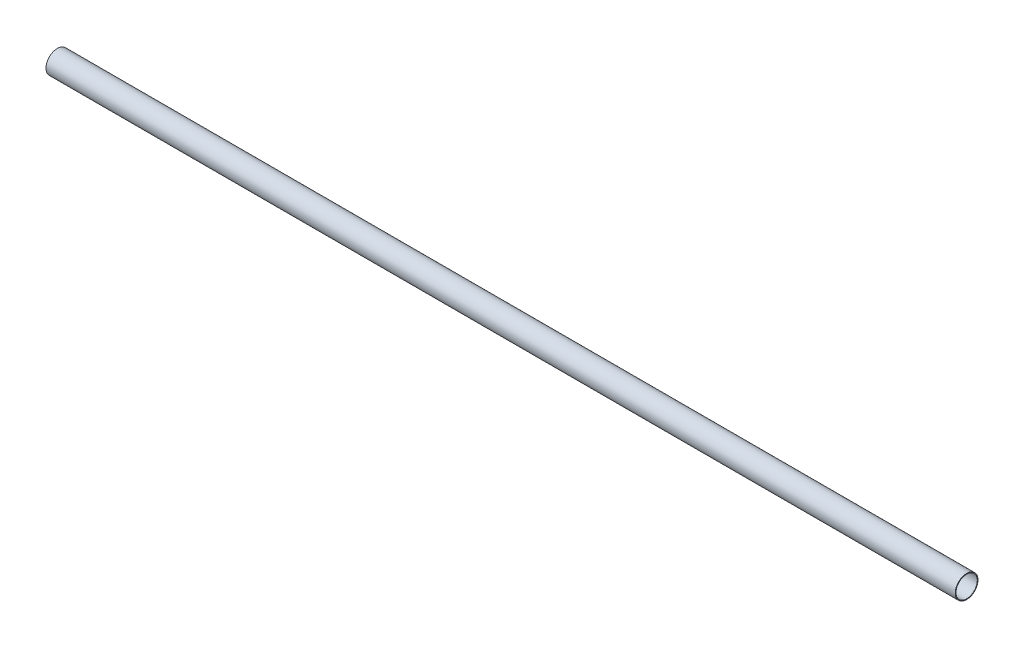
ISO-10303-21;
HEADER;
FILE_DESCRIPTION(('STEP AP214'),'2;1');
FILE_NAME('part.step','',(''),(''),'','','');
FILE_SCHEMA(('AUTOMOTIVE_DESIGN { 1 0 10303 214 1 1 1 1 }'));
ENDSEC;
DATA;
#1=APPLICATION_CONTEXT('core data for automotive mechanical design processes');
#2=APPLICATION_PROTOCOL_DEFINITION('international standard','automotive_design',2000,#1);
#3=PRODUCT_CONTEXT('',#1,'mechanical');
#4=PRODUCT('Part','Part','',(#3));
#5=PRODUCT_RELATED_PRODUCT_CATEGORY('part','',(#4));
#6=PRODUCT_DEFINITION_FORMATION('','',#4);
#7=PRODUCT_DEFINITION_CONTEXT('part definition',#1,'design');
#8=PRODUCT_DEFINITION('design','',#6,#7);
#9=PRODUCT_DEFINITION_SHAPE('','',#8);
#10=(LENGTH_UNIT() NAMED_UNIT(*) SI_UNIT(.MILLI.,.METRE.));
#11=(NAMED_UNIT(*) PLANE_ANGLE_UNIT() SI_UNIT($,.RADIAN.));
#12=(NAMED_UNIT(*) SI_UNIT($,.STERADIAN.) SOLID_ANGLE_UNIT());
#13=UNCERTAINTY_MEASURE_WITH_UNIT(LENGTH_MEASURE(1.E-05),#10,'distance_accuracy_value','');
#14=(GEOMETRIC_REPRESENTATION_CONTEXT(3) GLOBAL_UNCERTAINTY_ASSIGNED_CONTEXT((#13)) GLOBAL_UNIT_ASSIGNED_CONTEXT((#10,
#11,#12)) REPRESENTATION_CONTEXT('',''));
#15=CARTESIAN_POINT('',(0.,0.,0.));
#16=DIRECTION('',(0.,0.,1.));
#17=DIRECTION('',(1.,0.,0.));
#18=AXIS2_PLACEMENT_3D('',#15,#16,#17);
#19=CARTESIAN_POINT('',(2000.,0.,0.));
#20=DIRECTION('',(1.,0.,0.));
#21=DIRECTION('',(0.,0.,-1.));
#22=AXIS2_PLACEMENT_3D('',#19,#20,#21);
#23=PLANE('',#22);
#24=CARTESIAN_POINT('',(2000.,0.,0.));
#25=DIRECTION('',(1.,0.,0.));
#26=DIRECTION('',(0.,0.,-1.));
#27=AXIS2_PLACEMENT_3D('',#24,#25,#26);
#28=CIRCLE('',#27,25.);
#29=CARTESIAN_POINT('',(2000.,0.,-25.));
#30=VERTEX_POINT('',#29);
#31=EDGE_CURVE('E10',#30,#30,#28,.T.);
#32=ORIENTED_EDGE('',*,*,#31,.T.);
#33=EDGE_LOOP('',(#32));
#34=FACE_BOUND('',#33,.T.);
#35=CARTESIAN_POINT('',(2000.,0.,0.));
#36=DIRECTION('',(1.,0.,0.));
#37=DIRECTION('',(0.,0.,-1.));
#38=AXIS2_PLACEMENT_3D('',#35,#36,#37);
#39=CIRCLE('',#38,23.45);
#40=CARTESIAN_POINT('',(2000.,0.,-23.45));
#41=VERTEX_POINT('',#40);
#42=EDGE_CURVE('E48',#41,#41,#39,.T.);
#43=ORIENTED_EDGE('',*,*,#42,.F.);
#44=EDGE_LOOP('',(#43));
#45=FACE_BOUND('',#44,.T.);
#46=ADVANCED_FACE('F37',(#34,#45),#23,.T.);
#47=CARTESIAN_POINT('',(0.,0.,0.));
#48=DIRECTION('',(1.,0.,0.));
#49=DIRECTION('',(0.,0.,-1.));
#50=AXIS2_PLACEMENT_3D('',#47,#48,#49);
#51=PLANE('',#50);
#52=CARTESIAN_POINT('',(0.,0.,0.));
#53=DIRECTION('',(1.,0.,0.));
#54=DIRECTION('',(0.,0.,-1.));
#55=AXIS2_PLACEMENT_3D('',#52,#53,#54);
#56=CIRCLE('',#55,25.);
#57=CARTESIAN_POINT('',(0.,0.,-25.));
#58=VERTEX_POINT('',#57);
#59=EDGE_CURVE('E41',#58,#58,#56,.T.);
#60=ORIENTED_EDGE('',*,*,#59,.F.);
#61=EDGE_LOOP('',(#60));
#62=FACE_BOUND('',#61,.T.);
#63=CARTESIAN_POINT('',(0.,0.,0.));
#64=DIRECTION('',(1.,0.,0.));
#65=DIRECTION('',(0.,0.,-1.));
#66=AXIS2_PLACEMENT_3D('',#63,#64,#65);
#67=CIRCLE('',#66,23.45);
#68=CARTESIAN_POINT('',(0.,0.,-23.45));
#69=VERTEX_POINT('',#68);
#70=EDGE_CURVE('E50',#69,#69,#67,.T.);
#71=ORIENTED_EDGE('',*,*,#70,.T.);
#72=EDGE_LOOP('',(#71));
#73=FACE_BOUND('',#72,.T.);
#74=ADVANCED_FACE('F60',(#62,#73),#51,.F.);
#75=CARTESIAN_POINT('',(2000.,0.,0.));
#76=DIRECTION('',(-1.,0.,0.));
#77=DIRECTION('',(0.,0.,1.));
#78=AXIS2_PLACEMENT_3D('',#75,#76,#77);
#79=CYLINDRICAL_SURFACE('',#78,25.);
#80=ORIENTED_EDGE('',*,*,#31,.F.);
#81=EDGE_LOOP('',(#80));
#82=FACE_BOUND('',#81,.T.);
#83=ORIENTED_EDGE('',*,*,#59,.T.);
#84=EDGE_LOOP('',(#83));
#85=FACE_BOUND('',#84,.T.);
#86=ADVANCED_FACE('F39',(#82,#85),#79,.T.);
#87=CARTESIAN_POINT('',(2000.,0.,0.));
#88=DIRECTION('',(-1.,0.,0.));
#89=DIRECTION('',(0.,0.,1.));
#90=AXIS2_PLACEMENT_3D('',#87,#88,#89);
#91=CYLINDRICAL_SURFACE('',#90,23.45);
#92=ORIENTED_EDGE('',*,*,#42,.T.);
#93=EDGE_LOOP('',(#92));
#94=FACE_BOUND('',#93,.T.);
#95=ORIENTED_EDGE('',*,*,#70,.F.);
#96=EDGE_LOOP('',(#95));
#97=FACE_BOUND('',#96,.T.);
#98=ADVANCED_FACE('F56',(#94,#97),#91,.F.);
#99=CLOSED_SHELL('',(#46,#74,#86,#98));
#100=MANIFOLD_SOLID_BREP('B2',#99);
#101=ADVANCED_BREP_SHAPE_REPRESENTATION('',(#18,#100),#14);
#102=SHAPE_DEFINITION_REPRESENTATION(#9,#101);
ENDSEC;
END-ISO-10303-21;
